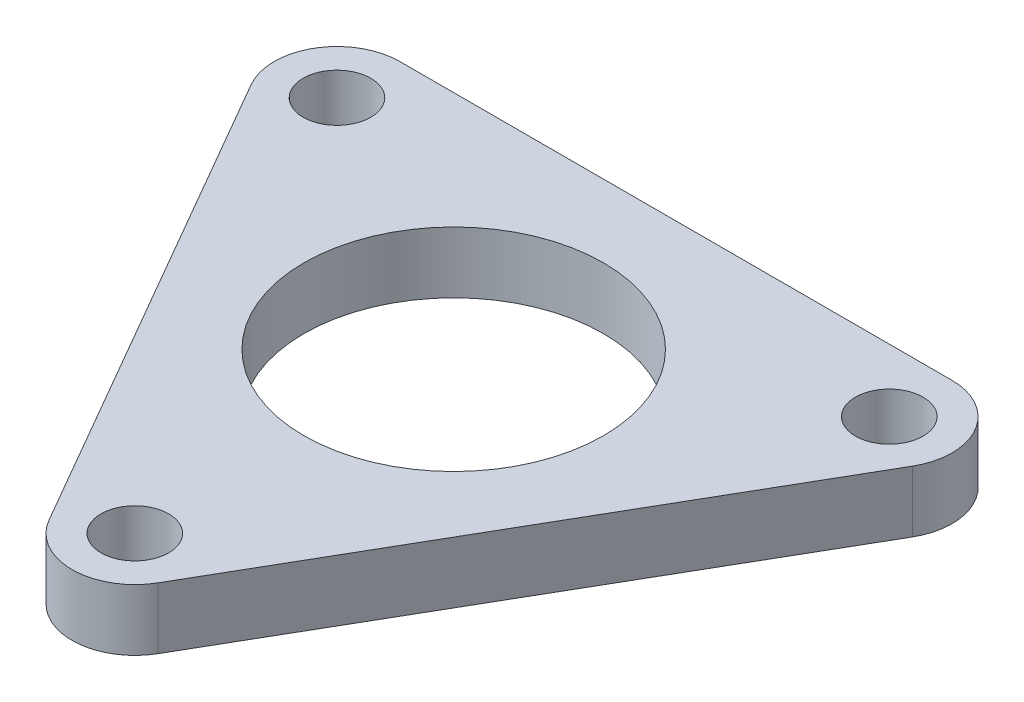
ISO-10303-21;
HEADER;
FILE_DESCRIPTION(('STEP AP214'),'2;1');
FILE_NAME('part.step','',(''),(''),'','','');
FILE_SCHEMA(('AUTOMOTIVE_DESIGN { 1 0 10303 214 1 1 1 1 }'));
ENDSEC;
DATA;
#1=APPLICATION_CONTEXT('core data for automotive mechanical design processes');
#2=APPLICATION_PROTOCOL_DEFINITION('international standard','automotive_design',2000,#1);
#3=PRODUCT_CONTEXT('',#1,'mechanical');
#4=PRODUCT('Part','Part','',(#3));
#5=PRODUCT_RELATED_PRODUCT_CATEGORY('part','',(#4));
#6=PRODUCT_DEFINITION_FORMATION('','',#4);
#7=PRODUCT_DEFINITION_CONTEXT('part definition',#1,'design');
#8=PRODUCT_DEFINITION('design','',#6,#7);
#9=PRODUCT_DEFINITION_SHAPE('','',#8);
#10=(LENGTH_UNIT() NAMED_UNIT(*) SI_UNIT(.MILLI.,.METRE.));
#11=(NAMED_UNIT(*) PLANE_ANGLE_UNIT() SI_UNIT($,.RADIAN.));
#12=(NAMED_UNIT(*) SI_UNIT($,.STERADIAN.) SOLID_ANGLE_UNIT());
#13=UNCERTAINTY_MEASURE_WITH_UNIT(LENGTH_MEASURE(1.E-05),#10,'distance_accuracy_value','');
#14=(GEOMETRIC_REPRESENTATION_CONTEXT(3) GLOBAL_UNCERTAINTY_ASSIGNED_CONTEXT((#13)) GLOBAL_UNIT_ASSIGNED_CONTEXT((#10,
#11,#12)) REPRESENTATION_CONTEXT('',''));
#15=CARTESIAN_POINT('',(0.,0.,0.));
#16=DIRECTION('',(0.,0.,1.));
#17=DIRECTION('',(1.,0.,0.));
#18=AXIS2_PLACEMENT_3D('',#15,#16,#17);
#19=CARTESIAN_POINT('',(-14.2894191624432,3.175,-8.25));
#20=DIRECTION('',(0.,1.,0.));
#21=DIRECTION('',(0.,0.,1.));
#22=AXIS2_PLACEMENT_3D('',#19,#20,#21);
#23=PLANE('',#22);
#24=CARTESIAN_POINT('',(0.,3.175,16.5));
#25=DIRECTION('',(0.,1.,0.));
#26=DIRECTION('',(0.,0.,1.));
#27=AXIS2_PLACEMENT_3D('',#24,#25,#26);
#28=CIRCLE('',#27,1.75);
#29=CARTESIAN_POINT('',(0.,3.175,18.25));
#30=VERTEX_POINT('',#29);
#31=EDGE_CURVE('E194',#30,#30,#28,.T.);
#32=ORIENTED_EDGE('',*,*,#31,.F.);
#33=EDGE_LOOP('',(#32));
#34=FACE_BOUND('',#33,.T.);
#35=CARTESIAN_POINT('',(0.,3.175,0.));
#36=DIRECTION('',(0.,1.,0.));
#37=DIRECTION('',(0.,0.,1.));
#38=AXIS2_PLACEMENT_3D('',#35,#36,#37);
#39=CIRCLE('',#38,7.75);
#40=CARTESIAN_POINT('',(0.,3.175,7.75));
#41=VERTEX_POINT('',#40);
#42=EDGE_CURVE('E126',#41,#41,#39,.T.);
#43=ORIENTED_EDGE('',*,*,#42,.F.);
#44=EDGE_LOOP('',(#43));
#45=FACE_BOUND('',#44,.T.);
#46=CARTESIAN_POINT('',(-14.2894191624432,3.175,-8.25));
#47=DIRECTION('',(0.,1.,0.));
#48=DIRECTION('',(0.,0.,1.));
#49=AXIS2_PLACEMENT_3D('',#46,#47,#48);
#50=CIRCLE('',#49,3.25);
#51=CARTESIAN_POINT('',(-14.2894191624432,3.175,-11.5));
#52=VERTEX_POINT('',#51);
#53=CARTESIAN_POINT('',(-17.1040017247427,3.175,-6.625));
#54=VERTEX_POINT('',#53);
#55=EDGE_CURVE('E133',#52,#54,#50,.T.);
#56=ORIENTED_EDGE('',*,*,#55,.T.);
#57=DIRECTION('',(0.5,0.,0.866025403784438));
#58=VECTOR('',#57,1.);
#59=CARTESIAN_POINT('',(-17.1040017247427,3.175,-6.625));
#60=LINE('',#59,#58);
#61=CARTESIAN_POINT('',(-2.81458256229942,3.175,18.125));
#62=VERTEX_POINT('',#61);
#63=EDGE_CURVE('E91',#54,#62,#60,.T.);
#64=ORIENTED_EDGE('',*,*,#63,.T.);
#65=CARTESIAN_POINT('',(0.,3.175,16.5));
#66=DIRECTION('',(0.,1.,0.));
#67=DIRECTION('',(0.,0.,1.));
#68=AXIS2_PLACEMENT_3D('',#65,#66,#67);
#69=CIRCLE('',#68,3.25);
#70=CARTESIAN_POINT('',(2.81458256229942,3.175,18.125));
#71=VERTEX_POINT('',#70);
#72=EDGE_CURVE('E104',#62,#71,#69,.T.);
#73=ORIENTED_EDGE('',*,*,#72,.T.);
#74=DIRECTION('',(0.5,0.,-0.866025403784438));
#75=VECTOR('',#74,1.);
#76=CARTESIAN_POINT('',(2.81458256229942,3.175,18.125));
#77=LINE('',#76,#75);
#78=CARTESIAN_POINT('',(17.1040017247427,3.175,-6.625));
#79=VERTEX_POINT('',#78);
#80=EDGE_CURVE('E98',#71,#79,#77,.T.);
#81=ORIENTED_EDGE('',*,*,#80,.T.);
#82=CARTESIAN_POINT('',(14.2894191624432,3.175,-8.25));
#83=DIRECTION('',(0.,1.,0.));
#84=DIRECTION('',(0.,0.,1.));
#85=AXIS2_PLACEMENT_3D('',#82,#83,#84);
#86=CIRCLE('',#85,3.25);
#87=CARTESIAN_POINT('',(14.2894191624432,3.175,-11.5));
#88=VERTEX_POINT('',#87);
#89=EDGE_CURVE('E102',#79,#88,#86,.T.);
#90=ORIENTED_EDGE('',*,*,#89,.T.);
#91=DIRECTION('',(-1.,0.,0.));
#92=VECTOR('',#91,1.);
#93=CARTESIAN_POINT('',(-14.2894191624432,3.175,-11.5));
#94=LINE('',#93,#92);
#95=EDGE_CURVE('E54',#88,#52,#94,.T.);
#96=ORIENTED_EDGE('',*,*,#95,.T.);
#97=EDGE_LOOP('',(#56,#64,#73,#81,#90,#96));
#98=FACE_BOUND('',#97,.T.);
#99=CARTESIAN_POINT('',(-14.2894191624432,3.175,-8.25));
#100=DIRECTION('',(0.,1.,0.));
#101=DIRECTION('',(0.,0.,1.));
#102=AXIS2_PLACEMENT_3D('',#99,#100,#101);
#103=CIRCLE('',#102,1.75);
#104=CARTESIAN_POINT('',(-14.2894191624432,3.175,-6.5));
#105=VERTEX_POINT('',#104);
#106=EDGE_CURVE('E200',#105,#105,#103,.T.);
#107=ORIENTED_EDGE('',*,*,#106,.F.);
#108=EDGE_LOOP('',(#107));
#109=FACE_BOUND('',#108,.T.);
#110=CARTESIAN_POINT('',(14.2894191624432,3.175,-8.25));
#111=DIRECTION('',(0.,1.,0.));
#112=DIRECTION('',(0.,0.,1.));
#113=AXIS2_PLACEMENT_3D('',#110,#111,#112);
#114=CIRCLE('',#113,1.75);
#115=CARTESIAN_POINT('',(14.2894191624432,3.175,-6.5));
#116=VERTEX_POINT('',#115);
#117=EDGE_CURVE('E185',#116,#116,#114,.T.);
#118=ORIENTED_EDGE('',*,*,#117,.F.);
#119=EDGE_LOOP('',(#118));
#120=FACE_BOUND('',#119,.T.);
#121=ADVANCED_FACE('F37',(#34,#45,#98,#109,#120),#23,.T.);
#122=CARTESIAN_POINT('',(-14.2894191624432,0.,-8.25));
#123=DIRECTION('',(0.,1.,0.));
#124=DIRECTION('',(0.,0.,1.));
#125=AXIS2_PLACEMENT_3D('',#122,#123,#124);
#126=PLANE('',#125);
#127=CARTESIAN_POINT('',(0.,0.,16.5));
#128=DIRECTION('',(0.,1.,0.));
#129=DIRECTION('',(0.,0.,1.));
#130=AXIS2_PLACEMENT_3D('',#127,#128,#129);
#131=CIRCLE('',#130,1.75);
#132=CARTESIAN_POINT('',(0.,0.,18.25));
#133=VERTEX_POINT('',#132);
#134=EDGE_CURVE('E191',#133,#133,#131,.T.);
#135=ORIENTED_EDGE('',*,*,#134,.T.);
#136=EDGE_LOOP('',(#135));
#137=FACE_BOUND('',#136,.T.);
#138=CARTESIAN_POINT('',(0.,0.,0.));
#139=DIRECTION('',(0.,1.,0.));
#140=DIRECTION('',(0.,0.,1.));
#141=AXIS2_PLACEMENT_3D('',#138,#139,#140);
#142=CIRCLE('',#141,7.75);
#143=CARTESIAN_POINT('',(0.,0.,7.75));
#144=VERTEX_POINT('',#143);
#145=EDGE_CURVE('E203',#144,#144,#142,.T.);
#146=ORIENTED_EDGE('',*,*,#145,.T.);
#147=EDGE_LOOP('',(#146));
#148=FACE_BOUND('',#147,.T.);
#149=CARTESIAN_POINT('',(-14.2894191624432,0.,-8.25));
#150=DIRECTION('',(0.,1.,0.));
#151=DIRECTION('',(0.,0.,1.));
#152=AXIS2_PLACEMENT_3D('',#149,#150,#151);
#153=CIRCLE('',#152,3.25);
#154=CARTESIAN_POINT('',(-14.2894191624432,0.,-11.5));
#155=VERTEX_POINT('',#154);
#156=CARTESIAN_POINT('',(-17.1040017247427,0.,-6.625));
#157=VERTEX_POINT('',#156);
#158=EDGE_CURVE('E122',#155,#157,#153,.T.);
#159=ORIENTED_EDGE('',*,*,#158,.F.);
#160=DIRECTION('',(-1.,0.,0.));
#161=VECTOR('',#160,1.);
#162=CARTESIAN_POINT('',(-14.2894191624432,0.,-11.5));
#163=LINE('',#162,#161);
#164=CARTESIAN_POINT('',(14.2894191624432,0.,-11.5));
#165=VERTEX_POINT('',#164);
#166=EDGE_CURVE('E83',#165,#155,#163,.T.);
#167=ORIENTED_EDGE('',*,*,#166,.F.);
#168=CARTESIAN_POINT('',(14.2894191624432,0.,-8.25));
#169=DIRECTION('',(0.,1.,0.));
#170=DIRECTION('',(0.,0.,1.));
#171=AXIS2_PLACEMENT_3D('',#168,#169,#170);
#172=CIRCLE('',#171,3.25);
#173=CARTESIAN_POINT('',(17.1040017247427,0.,-6.625));
#174=VERTEX_POINT('',#173);
#175=EDGE_CURVE('E77',#174,#165,#172,.T.);
#176=ORIENTED_EDGE('',*,*,#175,.F.);
#177=DIRECTION('',(0.5,0.,-0.866025403784438));
#178=VECTOR('',#177,1.);
#179=CARTESIAN_POINT('',(2.81458256229942,0.,18.125));
#180=LINE('',#179,#178);
#181=CARTESIAN_POINT('',(2.81458256229942,0.,18.125));
#182=VERTEX_POINT('',#181);
#183=EDGE_CURVE('E112',#182,#174,#180,.T.);
#184=ORIENTED_EDGE('',*,*,#183,.F.);
#185=CARTESIAN_POINT('',(0.,0.,16.5));
#186=DIRECTION('',(0.,1.,0.));
#187=DIRECTION('',(0.,0.,1.));
#188=AXIS2_PLACEMENT_3D('',#185,#186,#187);
#189=CIRCLE('',#188,3.25);
#190=CARTESIAN_POINT('',(-2.81458256229942,0.,18.125));
#191=VERTEX_POINT('',#190);
#192=EDGE_CURVE('E128',#191,#182,#189,.T.);
#193=ORIENTED_EDGE('',*,*,#192,.F.);
#194=DIRECTION('',(0.5,0.,0.866025403784438));
#195=VECTOR('',#194,1.);
#196=CARTESIAN_POINT('',(-17.1040017247427,0.,-6.625));
#197=LINE('',#196,#195);
#198=EDGE_CURVE('E125',#157,#191,#197,.T.);
#199=ORIENTED_EDGE('',*,*,#198,.F.);
#200=EDGE_LOOP('',(#159,#167,#176,#184,#193,#199));
#201=FACE_BOUND('',#200,.T.);
#202=CARTESIAN_POINT('',(-14.2894191624432,0.,-8.25));
#203=DIRECTION('',(0.,1.,0.));
#204=DIRECTION('',(0.,0.,1.));
#205=AXIS2_PLACEMENT_3D('',#202,#203,#204);
#206=CIRCLE('',#205,1.75);
#207=CARTESIAN_POINT('',(-14.2894191624432,0.,-6.5));
#208=VERTEX_POINT('',#207);
#209=EDGE_CURVE('E197',#208,#208,#206,.T.);
#210=ORIENTED_EDGE('',*,*,#209,.T.);
#211=EDGE_LOOP('',(#210));
#212=FACE_BOUND('',#211,.T.);
#213=CARTESIAN_POINT('',(14.2894191624432,0.,-8.25));
#214=DIRECTION('',(0.,1.,0.));
#215=DIRECTION('',(0.,0.,1.));
#216=AXIS2_PLACEMENT_3D('',#213,#214,#215);
#217=CIRCLE('',#216,1.75);
#218=CARTESIAN_POINT('',(14.2894191624432,0.,-6.5));
#219=VERTEX_POINT('',#218);
#220=EDGE_CURVE('E188',#219,#219,#217,.T.);
#221=ORIENTED_EDGE('',*,*,#220,.T.);
#222=EDGE_LOOP('',(#221));
#223=FACE_BOUND('',#222,.T.);
#224=ADVANCED_FACE('F142',(#137,#148,#201,#212,#223),#126,.F.);
#225=CARTESIAN_POINT('',(-14.2894191624432,3.175,-8.25));
#226=DIRECTION('',(0.,-1.,0.));
#227=DIRECTION('',(0.,0.,-1.));
#228=AXIS2_PLACEMENT_3D('',#225,#226,#227);
#229=CYLINDRICAL_SURFACE('',#228,3.25);
#230=ORIENTED_EDGE('',*,*,#158,.T.);
#231=DIRECTION('',(0.,-1.,0.));
#232=VECTOR('',#231,1.);
#233=CARTESIAN_POINT('',(-17.1040017247427,3.175,-6.625));
#234=LINE('',#233,#232);
#235=EDGE_CURVE('E11',#54,#157,#234,.T.);
#236=ORIENTED_EDGE('',*,*,#235,.F.);
#237=ORIENTED_EDGE('',*,*,#55,.F.);
#238=DIRECTION('',(0.,-1.,0.));
#239=VECTOR('',#238,1.);
#240=CARTESIAN_POINT('',(-14.2894191624432,3.175,-11.5));
#241=LINE('',#240,#239);
#242=EDGE_CURVE('E118',#52,#155,#241,.T.);
#243=ORIENTED_EDGE('',*,*,#242,.T.);
#244=EDGE_LOOP('',(#230,#236,#237,#243));
#245=FACE_BOUND('',#244,.T.);
#246=ADVANCED_FACE('F39',(#245),#229,.T.);
#247=CARTESIAN_POINT('',(-17.1040017247427,3.175,-6.625));
#248=DIRECTION('',(0.866025403784438,0.,-0.5));
#249=DIRECTION('',(-0.5,0.,-0.866025403784439));
#250=AXIS2_PLACEMENT_3D('',#247,#248,#249);
#251=PLANE('',#250);
#252=ORIENTED_EDGE('',*,*,#198,.T.);
#253=DIRECTION('',(0.,-1.,0.));
#254=VECTOR('',#253,1.);
#255=CARTESIAN_POINT('',(-2.81458256229942,3.175,18.125));
#256=LINE('',#255,#254);
#257=EDGE_CURVE('E46',#62,#191,#256,.T.);
#258=ORIENTED_EDGE('',*,*,#257,.F.);
#259=ORIENTED_EDGE('',*,*,#63,.F.);
#260=ORIENTED_EDGE('',*,*,#235,.T.);
#261=EDGE_LOOP('',(#252,#258,#259,#260));
#262=FACE_BOUND('',#261,.T.);
#263=ADVANCED_FACE('F260',(#262),#251,.F.);
#264=CARTESIAN_POINT('',(0.,3.175,16.5));
#265=DIRECTION('',(0.,-1.,0.));
#266=DIRECTION('',(0.,0.,-1.));
#267=AXIS2_PLACEMENT_3D('',#264,#265,#266);
#268=CYLINDRICAL_SURFACE('',#267,3.25);
#269=ORIENTED_EDGE('',*,*,#192,.T.);
#270=DIRECTION('',(0.,-1.,0.));
#271=VECTOR('',#270,1.);
#272=CARTESIAN_POINT('',(2.81458256229942,3.175,18.125));
#273=LINE('',#272,#271);
#274=EDGE_CURVE('E113',#71,#182,#273,.T.);
#275=ORIENTED_EDGE('',*,*,#274,.F.);
#276=ORIENTED_EDGE('',*,*,#72,.F.);
#277=ORIENTED_EDGE('',*,*,#257,.T.);
#278=EDGE_LOOP('',(#269,#275,#276,#277));
#279=FACE_BOUND('',#278,.T.);
#280=ADVANCED_FACE('F139',(#279),#268,.T.);
#281=CARTESIAN_POINT('',(2.81458256229942,3.175,18.125));
#282=DIRECTION('',(-0.866025403784438,0.,-0.5));
#283=DIRECTION('',(-0.5,0.,0.866025403784439));
#284=AXIS2_PLACEMENT_3D('',#281,#282,#283);
#285=PLANE('',#284);
#286=ORIENTED_EDGE('',*,*,#183,.T.);
#287=DIRECTION('',(0.,-1.,0.));
#288=VECTOR('',#287,1.);
#289=CARTESIAN_POINT('',(17.1040017247427,3.175,-6.625));
#290=LINE('',#289,#288);
#291=EDGE_CURVE('E109',#79,#174,#290,.T.);
#292=ORIENTED_EDGE('',*,*,#291,.F.);
#293=ORIENTED_EDGE('',*,*,#80,.F.);
#294=ORIENTED_EDGE('',*,*,#274,.T.);
#295=EDGE_LOOP('',(#286,#292,#293,#294));
#296=FACE_BOUND('',#295,.T.);
#297=ADVANCED_FACE('F110',(#296),#285,.F.);
#298=CARTESIAN_POINT('',(14.2894191624432,3.175,-8.25));
#299=DIRECTION('',(0.,-1.,0.));
#300=DIRECTION('',(0.,0.,-1.));
#301=AXIS2_PLACEMENT_3D('',#298,#299,#300);
#302=CYLINDRICAL_SURFACE('',#301,3.25);
#303=ORIENTED_EDGE('',*,*,#175,.T.);
#304=DIRECTION('',(0.,-1.,0.));
#305=VECTOR('',#304,1.);
#306=CARTESIAN_POINT('',(14.2894191624432,3.175,-11.5));
#307=LINE('',#306,#305);
#308=EDGE_CURVE('E114',#88,#165,#307,.T.);
#309=ORIENTED_EDGE('',*,*,#308,.F.);
#310=ORIENTED_EDGE('',*,*,#89,.F.);
#311=ORIENTED_EDGE('',*,*,#291,.T.);
#312=EDGE_LOOP('',(#303,#309,#310,#311));
#313=FACE_BOUND('',#312,.T.);
#314=ADVANCED_FACE('F116',(#313),#302,.T.);
#315=CARTESIAN_POINT('',(-14.2894191624432,3.175,-11.5));
#316=DIRECTION('',(0.,0.,1.));
#317=DIRECTION('',(1.,0.,0.));
#318=AXIS2_PLACEMENT_3D('',#315,#316,#317);
#319=PLANE('',#318);
#320=ORIENTED_EDGE('',*,*,#166,.T.);
#321=ORIENTED_EDGE('',*,*,#242,.F.);
#322=ORIENTED_EDGE('',*,*,#95,.F.);
#323=ORIENTED_EDGE('',*,*,#308,.T.);
#324=EDGE_LOOP('',(#320,#321,#322,#323));
#325=FACE_BOUND('',#324,.T.);
#326=ADVANCED_FACE('F147',(#325),#319,.F.);
#327=CARTESIAN_POINT('',(0.,3.175,0.));
#328=DIRECTION('',(0.,-1.,0.));
#329=DIRECTION('',(0.,0.,-1.));
#330=AXIS2_PLACEMENT_3D('',#327,#328,#329);
#331=CYLINDRICAL_SURFACE('',#330,7.75);
#332=ORIENTED_EDGE('',*,*,#42,.T.);
#333=EDGE_LOOP('',(#332));
#334=FACE_BOUND('',#333,.T.);
#335=ORIENTED_EDGE('',*,*,#145,.F.);
#336=EDGE_LOOP('',(#335));
#337=FACE_BOUND('',#336,.T.);
#338=ADVANCED_FACE('F149',(#334,#337),#331,.F.);
#339=CARTESIAN_POINT('',(-14.2894191624432,3.175,-8.25));
#340=DIRECTION('',(0.,-1.,0.));
#341=DIRECTION('',(0.,0.,-1.));
#342=AXIS2_PLACEMENT_3D('',#339,#340,#341);
#343=CYLINDRICAL_SURFACE('',#342,1.75);
#344=ORIENTED_EDGE('',*,*,#106,.T.);
#345=EDGE_LOOP('',(#344));
#346=FACE_BOUND('',#345,.T.);
#347=ORIENTED_EDGE('',*,*,#209,.F.);
#348=EDGE_LOOP('',(#347));
#349=FACE_BOUND('',#348,.T.);
#350=ADVANCED_FACE('F155',(#346,#349),#343,.F.);
#351=CARTESIAN_POINT('',(0.,3.175,16.5));
#352=DIRECTION('',(0.,-1.,0.));
#353=DIRECTION('',(0.,0.,-1.));
#354=AXIS2_PLACEMENT_3D('',#351,#352,#353);
#355=CYLINDRICAL_SURFACE('',#354,1.75);
#356=ORIENTED_EDGE('',*,*,#31,.T.);
#357=EDGE_LOOP('',(#356));
#358=FACE_BOUND('',#357,.T.);
#359=ORIENTED_EDGE('',*,*,#134,.F.);
#360=EDGE_LOOP('',(#359));
#361=FACE_BOUND('',#360,.T.);
#362=ADVANCED_FACE('F172',(#358,#361),#355,.F.);
#363=CARTESIAN_POINT('',(14.2894191624432,3.175,-8.25));
#364=DIRECTION('',(0.,-1.,0.));
#365=DIRECTION('',(0.,0.,-1.));
#366=AXIS2_PLACEMENT_3D('',#363,#364,#365);
#367=CYLINDRICAL_SURFACE('',#366,1.75);
#368=ORIENTED_EDGE('',*,*,#117,.T.);
#369=EDGE_LOOP('',(#368));
#370=FACE_BOUND('',#369,.T.);
#371=ORIENTED_EDGE('',*,*,#220,.F.);
#372=EDGE_LOOP('',(#371));
#373=FACE_BOUND('',#372,.T.);
#374=ADVANCED_FACE('F176',(#370,#373),#367,.F.);
#375=CLOSED_SHELL('',(#121,#224,#246,#263,#280,#297,#314,#326,#338,#350,#362,#374));
#376=MANIFOLD_SOLID_BREP('B2',#375);
#377=ADVANCED_BREP_SHAPE_REPRESENTATION('',(#18,#376),#14);
#378=SHAPE_DEFINITION_REPRESENTATION(#9,#377);
ENDSEC;
END-ISO-10303-21;
